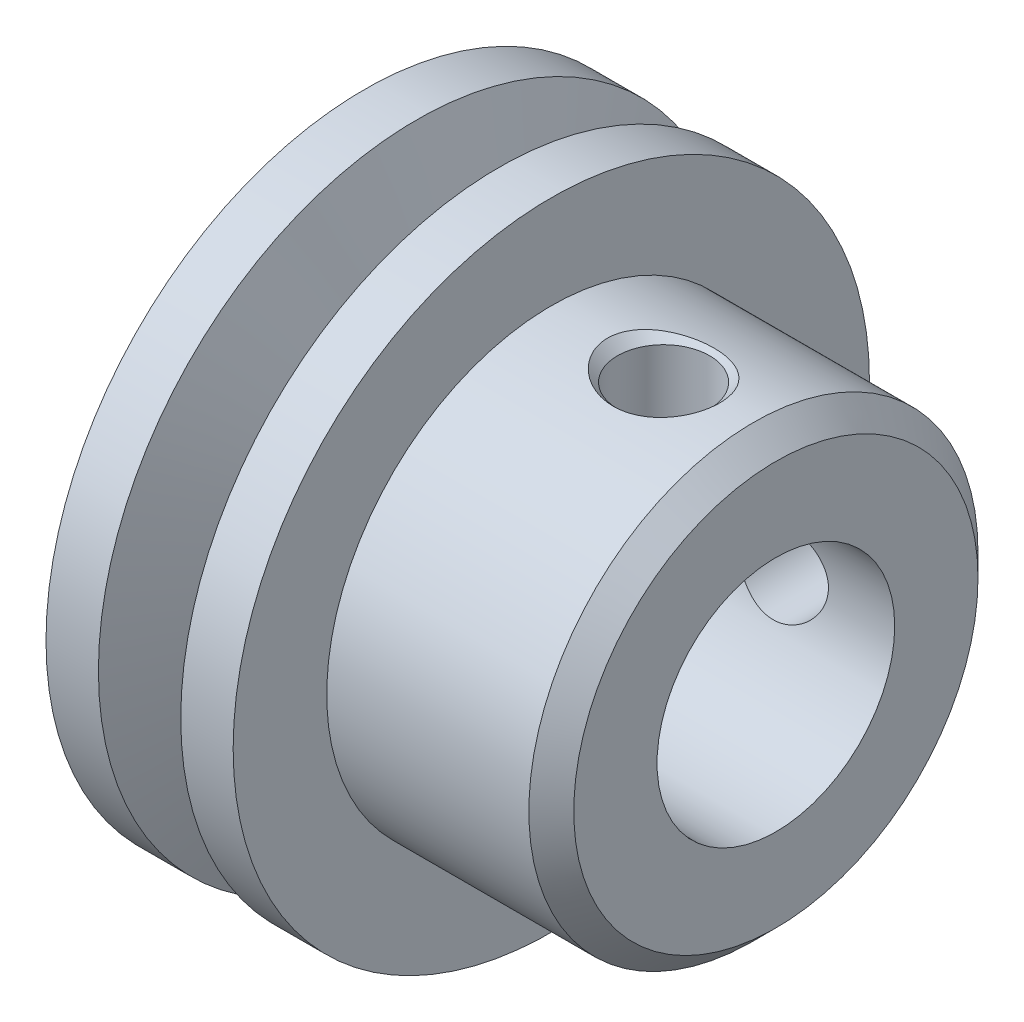
ISO-10303-21;
HEADER;
FILE_DESCRIPTION(('STEP AP214'),'2;1');
FILE_NAME('part.step','',(''),(''),'','','');
FILE_SCHEMA(('AUTOMOTIVE_DESIGN { 1 0 10303 214 1 1 1 1 }'));
ENDSEC;
DATA;
#1=APPLICATION_CONTEXT('core data for automotive mechanical design processes');
#2=APPLICATION_PROTOCOL_DEFINITION('international standard','automotive_design',2000,#1);
#3=PRODUCT_CONTEXT('',#1,'mechanical');
#4=PRODUCT('Part','Part','',(#3));
#5=PRODUCT_RELATED_PRODUCT_CATEGORY('part','',(#4));
#6=PRODUCT_DEFINITION_FORMATION('','',#4);
#7=PRODUCT_DEFINITION_CONTEXT('part definition',#1,'design');
#8=PRODUCT_DEFINITION('design','',#6,#7);
#9=PRODUCT_DEFINITION_SHAPE('','',#8);
#10=(LENGTH_UNIT() NAMED_UNIT(*) SI_UNIT(.MILLI.,.METRE.));
#11=(NAMED_UNIT(*) PLANE_ANGLE_UNIT() SI_UNIT($,.RADIAN.));
#12=(NAMED_UNIT(*) SI_UNIT($,.STERADIAN.) SOLID_ANGLE_UNIT());
#13=UNCERTAINTY_MEASURE_WITH_UNIT(LENGTH_MEASURE(1.E-05),#10,'distance_accuracy_value','');
#14=(GEOMETRIC_REPRESENTATION_CONTEXT(3) GLOBAL_UNCERTAINTY_ASSIGNED_CONTEXT((#13)) GLOBAL_UNIT_ASSIGNED_CONTEXT((#10,
#11,#12)) REPRESENTATION_CONTEXT('',''));
#15=CARTESIAN_POINT('',(0.,0.,0.));
#16=DIRECTION('',(0.,0.,1.));
#17=DIRECTION('',(1.,0.,0.));
#18=AXIS2_PLACEMENT_3D('',#15,#16,#17);
#19=CARTESIAN_POINT('',(2.5,0.,0.));
#20=DIRECTION('',(-1.,0.,0.));
#21=DIRECTION('',(0.,0.,1.));
#22=AXIS2_PLACEMENT_3D('',#19,#20,#21);
#23=CYLINDRICAL_SURFACE('',#22,8.5);
#24=CARTESIAN_POINT('',(2.5,0.,0.));
#25=DIRECTION('',(-1.,0.,0.));
#26=DIRECTION('',(0.,0.,1.));
#27=AXIS2_PLACEMENT_3D('',#24,#25,#26);
#28=CIRCLE('',#27,8.5);
#29=CARTESIAN_POINT('',(2.5,0.,8.5));
#30=VERTEX_POINT('',#29);
#31=EDGE_CURVE('E161',#30,#30,#28,.T.);
#32=ORIENTED_EDGE('',*,*,#31,.T.);
#33=EDGE_LOOP('',(#32));
#34=FACE_BOUND('',#33,.T.);
#35=CARTESIAN_POINT('',(1.1,0.,0.));
#36=DIRECTION('',(-1.,0.,0.));
#37=DIRECTION('',(0.,0.,1.));
#38=AXIS2_PLACEMENT_3D('',#35,#36,#37);
#39=CIRCLE('',#38,8.5);
#40=CARTESIAN_POINT('',(1.1,0.,8.5));
#41=VERTEX_POINT('',#40);
#42=EDGE_CURVE('E144',#41,#41,#39,.T.);
#43=ORIENTED_EDGE('',*,*,#42,.F.);
#44=EDGE_LOOP('',(#43));
#45=FACE_BOUND('',#44,.T.);
#46=ADVANCED_FACE('F30',(#34,#45),#23,.T.);
#47=CARTESIAN_POINT('',(2.5,8.5,0.));
#48=DIRECTION('',(1.,0.,0.));
#49=DIRECTION('',(0.,0.,-1.));
#50=AXIS2_PLACEMENT_3D('',#47,#48,#49);
#51=PLANE('',#50);
#52=CARTESIAN_POINT('',(2.5,0.,0.));
#53=DIRECTION('',(1.,0.,0.));
#54=DIRECTION('',(0.,0.,-1.));
#55=AXIS2_PLACEMENT_3D('',#52,#53,#54);
#56=CIRCLE('',#55,6.);
#57=CARTESIAN_POINT('',(2.5,0.,-6.));
#58=VERTEX_POINT('',#57);
#59=EDGE_CURVE('E153',#58,#58,#56,.T.);
#60=ORIENTED_EDGE('',*,*,#59,.F.);
#61=EDGE_LOOP('',(#60));
#62=FACE_BOUND('',#61,.T.);
#63=ORIENTED_EDGE('',*,*,#31,.F.);
#64=EDGE_LOOP('',(#63));
#65=FACE_BOUND('',#64,.T.);
#66=ADVANCED_FACE('F110',(#62,#65),#51,.T.);
#67=CARTESIAN_POINT('',(-2.5,0.,0.));
#68=DIRECTION('',(-1.,0.,0.));
#69=DIRECTION('',(0.,0.,1.));
#70=AXIS2_PLACEMENT_3D('',#67,#68,#69);
#71=PLANE('',#70);
#72=CARTESIAN_POINT('',(-2.5,0.,0.));
#73=DIRECTION('',(1.,0.,0.));
#74=DIRECTION('',(0.,0.,-1.));
#75=AXIS2_PLACEMENT_3D('',#72,#73,#74);
#76=CIRCLE('',#75,3.17500000000001);
#77=CARTESIAN_POINT('',(-2.5,0.,-3.17500000000001));
#78=VERTEX_POINT('',#77);
#79=EDGE_CURVE('E169',#78,#78,#76,.T.);
#80=ORIENTED_EDGE('',*,*,#79,.T.);
#81=EDGE_LOOP('',(#80));
#82=FACE_BOUND('',#81,.T.);
#83=CARTESIAN_POINT('',(-2.5,0.,0.));
#84=DIRECTION('',(-1.,0.,0.));
#85=DIRECTION('',(0.,0.,1.));
#86=AXIS2_PLACEMENT_3D('',#83,#84,#85);
#87=CIRCLE('',#86,8.5);
#88=CARTESIAN_POINT('',(-2.5,0.,8.5));
#89=VERTEX_POINT('',#88);
#90=EDGE_CURVE('E159',#89,#89,#87,.T.);
#91=ORIENTED_EDGE('',*,*,#90,.T.);
#92=EDGE_LOOP('',(#91));
#93=FACE_BOUND('',#92,.T.);
#94=ADVANCED_FACE('F115',(#82,#93),#71,.T.);
#95=CARTESIAN_POINT('',(2.5,0.,0.));
#96=DIRECTION('',(-1.,0.,0.));
#97=DIRECTION('',(0.,0.,1.));
#98=AXIS2_PLACEMENT_3D('',#95,#96,#97);
#99=CYLINDRICAL_SURFACE('',#98,8.5);
#100=CARTESIAN_POINT('',(-1.1,0.,0.));
#101=DIRECTION('',(-1.,0.,0.));
#102=DIRECTION('',(0.,0.,1.));
#103=AXIS2_PLACEMENT_3D('',#100,#101,#102);
#104=CIRCLE('',#103,8.5);
#105=CARTESIAN_POINT('',(-1.1,0.,8.5));
#106=VERTEX_POINT('',#105);
#107=EDGE_CURVE('E151',#106,#106,#104,.T.);
#108=ORIENTED_EDGE('',*,*,#107,.T.);
#109=EDGE_LOOP('',(#108));
#110=FACE_BOUND('',#109,.T.);
#111=ORIENTED_EDGE('',*,*,#90,.F.);
#112=EDGE_LOOP('',(#111));
#113=FACE_BOUND('',#112,.T.);
#114=ADVANCED_FACE('F123',(#110,#113),#99,.T.);
#115=CARTESIAN_POINT('',(-1.1,0.,0.));
#116=DIRECTION('',(-1.,0.,0.));
#117=DIRECTION('',(0.,0.,1.));
#118=AXIS2_PLACEMENT_3D('',#115,#116,#117);
#119=CONICAL_SURFACE('',#118,8.5,1.17809724508205);
#120=CARTESIAN_POINT('',(-0.271572875220727,0.,0.));
#121=DIRECTION('',(-1.,0.,0.));
#122=DIRECTION('',(0.,0.,1.));
#123=AXIS2_PLACEMENT_3D('',#120,#121,#122);
#124=CIRCLE('',#123,6.5);
#125=CARTESIAN_POINT('',(-0.271572875220727,0.,6.5));
#126=VERTEX_POINT('',#125);
#127=EDGE_CURVE('E148',#126,#126,#124,.T.);
#128=ORIENTED_EDGE('',*,*,#127,.T.);
#129=EDGE_LOOP('',(#128));
#130=FACE_BOUND('',#129,.T.);
#131=ORIENTED_EDGE('',*,*,#107,.F.);
#132=EDGE_LOOP('',(#131));
#133=FACE_BOUND('',#132,.T.);
#134=ADVANCED_FACE('F127',(#130,#133),#119,.T.);
#135=CARTESIAN_POINT('',(2.5,0.,0.));
#136=DIRECTION('',(-1.,0.,0.));
#137=DIRECTION('',(0.,0.,1.));
#138=AXIS2_PLACEMENT_3D('',#135,#136,#137);
#139=CYLINDRICAL_SURFACE('',#138,6.5);
#140=CARTESIAN_POINT('',(0.27157287525381,0.,0.));
#141=DIRECTION('',(-1.,0.,0.));
#142=DIRECTION('',(0.,0.,1.));
#143=AXIS2_PLACEMENT_3D('',#140,#141,#142);
#144=CIRCLE('',#143,6.5);
#145=CARTESIAN_POINT('',(0.27157287525381,0.,6.5));
#146=VERTEX_POINT('',#145);
#147=EDGE_CURVE('E147',#146,#146,#144,.T.);
#148=ORIENTED_EDGE('',*,*,#147,.T.);
#149=EDGE_LOOP('',(#148));
#150=FACE_BOUND('',#149,.T.);
#151=ORIENTED_EDGE('',*,*,#127,.F.);
#152=EDGE_LOOP('',(#151));
#153=FACE_BOUND('',#152,.T.);
#154=ADVANCED_FACE('F131',(#150,#153),#139,.T.);
#155=CARTESIAN_POINT('',(0.27157287525381,0.,0.));
#156=DIRECTION('',(1.,0.,0.));
#157=DIRECTION('',(0.,0.,-1.));
#158=AXIS2_PLACEMENT_3D('',#155,#156,#157);
#159=CONICAL_SURFACE('',#158,6.5,1.17809724509617);
#160=ORIENTED_EDGE('',*,*,#42,.T.);
#161=EDGE_LOOP('',(#160));
#162=FACE_BOUND('',#161,.T.);
#163=ORIENTED_EDGE('',*,*,#147,.F.);
#164=EDGE_LOOP('',(#163));
#165=FACE_BOUND('',#164,.T.);
#166=ADVANCED_FACE('F134',(#162,#165),#159,.T.);
#167=CARTESIAN_POINT('',(8.5,0.,0.));
#168=DIRECTION('',(-1.,0.,0.));
#169=DIRECTION('',(0.,0.,1.));
#170=AXIS2_PLACEMENT_3D('',#167,#168,#169);
#171=CYLINDRICAL_SURFACE('',#170,6.);
#172=CARTESIAN_POINT('',(7.89999999998008,0.,0.));
#173=DIRECTION('',(1.,0.,0.));
#174=DIRECTION('',(0.,0.,-1.));
#175=AXIS2_PLACEMENT_3D('',#172,#173,#174);
#176=CIRCLE('',#175,6.);
#177=CARTESIAN_POINT('',(7.89999999998008,0.,-6.));
#178=VERTEX_POINT('',#177);
#179=EDGE_CURVE('E10',#178,#178,#176,.F.);
#180=ORIENTED_EDGE('',*,*,#179,.T.);
#181=EDGE_LOOP('',(#180));
#182=FACE_BOUND('',#181,.T.);
#183=CARTESIAN_POINT('',(4.48757366091486,5.91742465217051,-0.992010854846125));
#184=CARTESIAN_POINT('',(4.55363181961201,5.90830786325476,-1.04639652813327));
#185=CARTESIAN_POINT('',(4.62453543924516,5.89938538901562,-1.09503950343004));
#186=CARTESIAN_POINT('',(4.77362862933216,5.88298642084079,-1.1799801888337));
#187=CARTESIAN_POINT('',(4.85183128037495,5.87551259972003,-1.21625517138769));
#188=CARTESIAN_POINT('',(5.01348918022317,5.86284003193611,-1.27594817621488));
#189=CARTESIAN_POINT('',(5.09696204273264,5.85764943245385,-1.29932023162618));
#190=CARTESIAN_POINT('',(5.26662594240205,5.85015953600291,-1.33263895459587));
#191=CARTESIAN_POINT('',(5.35281595388092,5.84785916110489,-1.34259062748078));
#192=CARTESIAN_POINT('',(5.52945215691767,5.84636934715403,-1.34906685056425));
#193=CARTESIAN_POINT('',(5.61992197284033,5.84731795903655,-1.34499551599462));
#194=CARTESIAN_POINT('',(5.79891432861927,5.85252314554906,-1.32215992489514));
#195=CARTESIAN_POINT('',(5.88743635456333,5.85678058268059,-1.30339183739719));
#196=CARTESIAN_POINT('',(6.0603123818507,5.86811483261557,-1.25137380475937));
#197=CARTESIAN_POINT('',(6.14464920160799,5.87520233488683,-1.21806890757161));
#198=CARTESIAN_POINT('',(6.30620910504696,5.8913301883883,-1.13750159188505));
#199=CARTESIAN_POINT('',(6.38343175476744,5.90037065863632,-1.09023832267039));
#200=CARTESIAN_POINT('',(6.52589828637423,5.91897143465703,-0.984166526779362));
#201=CARTESIAN_POINT('',(6.591428596566,5.92850850122736,-0.92574021387052));
#202=CARTESIAN_POINT('',(6.71052568987282,5.94709295036652,-0.797654746022983));
#203=CARTESIAN_POINT('',(6.76410021060564,5.95614064675901,-0.728002906655421));
#204=CARTESIAN_POINT('',(6.85233158078746,5.97170226674873,-0.586002349050411));
#205=CARTESIAN_POINT('',(6.8882581436275,5.97837104858305,-0.514462300386366));
#206=CARTESIAN_POINT('',(6.94589315456136,5.9893064221646,-0.365705879363942));
#207=CARTESIAN_POINT('',(6.96761698384612,5.99357561190214,-0.288495748728199));
#208=CARTESIAN_POINT('',(6.99380376850009,5.99875411035678,-0.140587670740879));
#209=CARTESIAN_POINT('',(7.00001250445118,6.00000266635157,-0.0702075260992267));
#210=CARTESIAN_POINT('',(6.99998747358026,5.99999732924591,0.0705405819267051));
#211=CARTESIAN_POINT('',(6.99375793668964,5.99874428687369,0.140908541316099));
#212=CARTESIAN_POINT('',(6.96991371137492,5.99403051456515,0.275464655883926));
#213=CARTESIAN_POINT('',(6.95296327147272,5.99069873300216,0.339777175910839));
#214=CARTESIAN_POINT('',(6.90910176683942,5.98229987141036,0.464775134725323));
#215=CARTESIAN_POINT('',(6.88218943791913,5.97723257114588,0.525460112032704));
#216=CARTESIAN_POINT('',(6.81811437272759,5.96560422923894,0.644435624101561));
#217=CARTESIAN_POINT('',(6.78055642539195,5.95898776607111,0.702506933408986));
#218=CARTESIAN_POINT('',(6.69712630096877,5.94502843099005,0.812220231927409));
#219=CARTESIAN_POINT('',(6.65125093814583,5.93768528123257,0.863859744803153));
#220=CARTESIAN_POINT('',(6.54735531231745,5.92213282529493,0.965003618208063));
#221=CARTESIAN_POINT('',(6.48856591863458,5.91391344831605,1.01371604963098));
#222=CARTESIAN_POINT('',(6.36421874892842,5.8981591382164,1.10168963583188));
#223=CARTESIAN_POINT('',(6.29865796453468,5.89062451213327,1.14094656371948));
#224=CARTESIAN_POINT('',(6.15530569309493,5.876216745316,1.21308430597829));
#225=CARTESIAN_POINT('',(6.07695114801924,5.86949362202817,1.24487917351758));
#226=CARTESIAN_POINT('',(5.91608850667425,5.85844272780628,1.29589019358384));
#227=CARTESIAN_POINT('',(5.83357923919134,5.85411563648293,1.31510277755287));
#228=CARTESIAN_POINT('',(5.66165359695121,5.84814906802447,1.34139907834455));
#229=CARTESIAN_POINT('',(5.57211346562383,5.84667917739019,1.34771852252401));
#230=CARTESIAN_POINT('',(5.39318722341021,5.84710995108764,1.34584711224697));
#231=CARTESIAN_POINT('',(5.30380113588577,5.84901108815313,1.33765422266343));
#232=CARTESIAN_POINT('',(5.12640318954032,5.85601026980822,1.30667462121034));
#233=CARTESIAN_POINT('',(5.03842878104088,5.86115325678942,1.28368265053342));
#234=CARTESIAN_POINT('',(4.86774564779565,5.87405421705983,1.22328873878857));
#235=CARTESIAN_POINT('',(4.78503763362446,5.88181254234158,1.18588485795687));
#236=CARTESIAN_POINT('',(4.62868834758188,5.89885584024847,1.09793936148491));
#237=CARTESIAN_POINT('',(4.55493159595345,5.90811667587562,1.0475991055677));
#238=CARTESIAN_POINT('',(4.41775902049772,5.92707191538146,0.934397619190823));
#239=CARTESIAN_POINT('',(4.3543401267073,5.93676618945117,0.871540118255766));
#240=CARTESIAN_POINT('',(4.24451804836834,5.95462981302145,0.739274435941501));
#241=CARTESIAN_POINT('',(4.19725931708155,5.96285781968524,0.670587636857619));
#242=CARTESIAN_POINT('',(4.11666617177209,5.97740414856912,0.525298729266001));
#243=CARTESIAN_POINT('',(4.08331636604259,5.9837245795721,0.44870548784417));
#244=CARTESIAN_POINT('',(4.03561102361376,5.99292477914225,0.299597112631546));
#245=CARTESIAN_POINT('',(4.01947649569918,5.99612289589478,0.227669805112668));
#246=CARTESIAN_POINT('',(4.00056994460918,5.99988014656912,0.0820252488615707));
#247=CARTESIAN_POINT('',(3.99778908698481,6.00044102521554,0.00830921596217015));
#248=CARTESIAN_POINT('',(4.00538396522914,5.99892462615997,-0.131853900867108));
#249=CARTESIAN_POINT('',(4.0146209857414,5.99707565796216,-0.198368680010217));
#250=CARTESIAN_POINT('',(4.04385152538657,5.99133485318473,-0.328901096278445));
#251=CARTESIAN_POINT('',(4.06384716852704,5.98744261321844,-0.392918237633052));
#252=CARTESIAN_POINT('',(4.11392223533623,5.97797718597371,-0.517427587169158));
#253=CARTESIAN_POINT('',(4.14409625848337,5.97238828025757,-0.577880233499699));
#254=CARTESIAN_POINT('',(4.21327228913968,5.96009115091553,-0.693313939580885));
#255=CARTESIAN_POINT('',(4.25226932215909,5.95338355857287,-0.748298057484379));
#256=CARTESIAN_POINT('',(4.32392793662147,5.94170390349792,-0.835108820874635));
#257=CARTESIAN_POINT('',(4.35454975603995,5.93687348554887,-0.868667333602712));
#258=CARTESIAN_POINT('',(4.41885111111889,5.92715203379582,-0.932692841042324));
#259=CARTESIAN_POINT('',(4.45253058668691,5.92226100118471,-0.963159896485691));
#260=CARTESIAN_POINT('',(4.48757366091486,5.91742465217051,-0.992010854846125));
#261=B_SPLINE_CURVE_WITH_KNOTS('',3,(#183,#184,#185,#186,#187,#188,#189,#190,#191,#192,#193,
#194,#195,#196,#197,#198,#199,#200,#201,#202,#203,#204,#205,#206,#207,#208,#209,#210,#211,#212,
#213,#214,#215,#216,#217,#218,#219,#220,#221,#222,#223,#224,#225,#226,#227,#228,#229,#230,#231,
#232,#233,#234,#235,#236,#237,#238,#239,#240,#241,#242,#243,#244,#245,#246,#247,#248,#249,#250,
#251,#252,#253,#254,#255,#256,#257,#258,#259,#260),.UNSPECIFIED.,.T.,.F.,(4,2,2,2,2,2,2,2,2,2,2,
2,2,2,2,2,2,2,2,2,2,2,2,2,2,2,2,2,2,2,2,2,2,2,2,2,2,2,4),(0.,0.257980145715,0.516431835124361,
0.775798416689689,1.0350682369446,1.30548879870758,1.575979873838,1.84750243695284,
2.11904155187145,2.3825608334294,2.6459090712264,2.88552537656222,3.12488175192343,
3.33576723437471,3.54658101240203,3.74546460939209,3.94437345387675,4.15194095008804,
4.35958811737834,4.58901282748934,4.81853990768817,5.07190982687174,5.32535157515601,
5.59342526363917,5.86153654822607,6.13344901182128,6.40539808612891,6.67334659781005,
6.94121539311679,7.19113126605655,7.44076984192971,7.66090547990702,7.88089546165662,
8.08148342523696,8.28211100418259,8.48465712068415,8.68708932324999,8.82394743754306,
8.96080286273096),.UNSPECIFIED.);
#262=CARTESIAN_POINT('',(4.48757366091486,5.91742465217051,-0.992010854846125));
#263=VERTEX_POINT('',#262);
#264=EDGE_CURVE('E41',#263,#263,#261,.T.);
#265=ORIENTED_EDGE('',*,*,#264,.T.);
#266=EDGE_LOOP('',(#265));
#267=FACE_BOUND('',#266,.T.);
#268=CARTESIAN_POINT('',(4.48757366103645,-0.992010854743913,-5.91742465218764));
#269=CARTESIAN_POINT('',(4.5536318197212,-1.0463965280255,-5.90830786327379));
#270=CARTESIAN_POINT('',(4.62453543934137,-1.09503950331784,-5.89938538903642));
#271=CARTESIAN_POINT('',(4.77362862940185,-1.17998018871469,-5.88298642086463));
#272=CARTESIAN_POINT('',(4.85183128043109,-1.21625517126632,-5.87551259974514));
#273=CARTESIAN_POINT('',(5.01348918025157,-1.2759481760905,-5.86284003196317));
#274=CARTESIAN_POINT('',(5.09696204274683,-1.29932023150122,-5.85764943248157));
#275=CARTESIAN_POINT('',(5.26662594238793,-1.3326389544717,-5.8501595360312));
#276=CARTESIAN_POINT('',(5.35281595385271,-1.34259062735796,-5.84785916113309));
#277=CARTESIAN_POINT('',(5.52945215685946,-1.34906685044603,-5.84636934718131));
#278=CARTESIAN_POINT('',(5.61992197276623,-1.34499551587997,-5.84731795906291));
#279=CARTESIAN_POINT('',(5.79891432851421,-1.32215992479014,-5.85252314557277));
#280=CARTESIAN_POINT('',(5.88743635444319,-1.30339183729827,-5.85678058270258));
#281=CARTESIAN_POINT('',(6.06031238170173,-1.2513738046751,-5.8681148326335));
#282=CARTESIAN_POINT('',(6.14464920144525,-1.21806890749591,-5.87520233490245));
#283=CARTESIAN_POINT('',(6.30620910485859,-1.13750159182907,-5.89133018839904));
#284=CARTESIAN_POINT('',(6.38343175456719,-1.09023832262556,-5.90037065864448));
#285=CARTESIAN_POINT('',(6.52589828615489,-0.984166526757887,-5.9189714346605));
#286=CARTESIAN_POINT('',(6.59142859633914,-0.925740213860899,-5.92850850122872));
#287=CARTESIAN_POINT('',(6.71052568963406,-0.797654746038963,-5.94709295036424));
#288=CARTESIAN_POINT('',(6.76410021036249,-0.728002906685138,-5.9561406467552));
#289=CARTESIAN_POINT('',(6.8523315805426,-0.586002349103613,-5.9717022667434));
#290=CARTESIAN_POINT('',(6.88825814338421,-0.514462300448715,-5.97837104857757));
#291=CARTESIAN_POINT('',(6.94589315432384,-0.36570587944439,-5.98930642215958));
#292=CARTESIAN_POINT('',(6.96761698361278,-0.288495748817597,-5.99357561189773));
#293=CARTESIAN_POINT('',(6.99380376827799,-0.140587670842001,-5.99875411035437));
#294=CARTESIAN_POINT('',(7.00001250423509,-0.0702075262030989,-6.00000266635033));
#295=CARTESIAN_POINT('',(6.99998747337661,0.0705405818184794,-5.99999732924716));
#296=CARTESIAN_POINT('',(6.99375793649242,0.140908541206269,-5.99874428687626));
#297=CARTESIAN_POINT('',(6.96991371119016,0.275464655772296,-5.99403051457027));
#298=CARTESIAN_POINT('',(6.95296327129396,0.339777175798943,-5.99069873300851));
#299=CARTESIAN_POINT('',(6.90910176667224,0.464775134613711,-5.98229987141903));
#300=CARTESIAN_POINT('',(6.88218943775753,0.525460111921641,-5.97723257115565));
#301=CARTESIAN_POINT('',(6.81811437257795,0.644435623989818,-5.965604229251));
#302=CARTESIAN_POINT('',(6.78055642524904,0.702506933296241,-5.9589877660844));
#303=CARTESIAN_POINT('',(6.697126300839,0.812220231813347,-5.94502843100563));
#304=CARTESIAN_POINT('',(6.65125093802248,0.863859744688776,-5.93768528124921));
#305=CARTESIAN_POINT('',(6.54735531220968,0.965003618090935,-5.92213282531399));
#306=CARTESIAN_POINT('',(6.48856591853633,1.01371604951186,-5.91391344833645));
#307=CARTESIAN_POINT('',(6.36421874884918,1.10168963570982,-5.89815913823919));
#308=CARTESIAN_POINT('',(6.29865796446492,1.14094656359646,-5.8906245121571));
#309=CARTESIAN_POINT('',(6.15530569304793,1.21308430585257,-5.87621674534194));
#310=CARTESIAN_POINT('',(6.07695114798573,1.2448791733907,-5.86949362205508));
#311=CARTESIAN_POINT('',(5.91608850666771,1.29589019345639,-5.85844272783447));
#312=CARTESIAN_POINT('',(5.83357923919828,1.31510277742603,-5.85411563651143));
#313=CARTESIAN_POINT('',(5.66165359698748,1.34139907822035,-5.84814906805296));
#314=CARTESIAN_POINT('',(5.57211346567599,1.34771852240226,-5.84667917741826));
#315=CARTESIAN_POINT('',(5.39318722349352,1.34584711213251,-5.84710995111398));
#316=CARTESIAN_POINT('',(5.30380113598435,1.33765422255383,-5.84901108817818));
#317=CARTESIAN_POINT('',(5.12640318966897,1.30667462111293,-5.85601026982994));
#318=CARTESIAN_POINT('',(5.0384287811843,1.28368265044344,-5.86115325680908));
#319=CARTESIAN_POINT('',(4.86774564796703,1.22328873871603,-5.87405421707489));
#320=CARTESIAN_POINT('',(4.78503763380903,1.18588485789432,-5.88181254235411));
#321=CARTESIAN_POINT('',(4.62868834778938,1.09793936144421,-5.89885584025597));
#322=CARTESIAN_POINT('',(4.55493159617081,1.04759910553864,-5.90811667588065));
#323=CARTESIAN_POINT('',(4.41775902073198,0.934397619187291,-5.92707191538189));
#324=CARTESIAN_POINT('',(4.3543401269486,0.871540118266114,-5.93676618944948));
#325=CARTESIAN_POINT('',(4.24451804861677,0.739274435977521,-5.95462981301686));
#326=CARTESIAN_POINT('',(4.19725931733089,0.67058763690482,-5.96285781967979));
#327=CARTESIAN_POINT('',(4.11666617202007,0.525298729336038,-5.97740414856283));
#328=CARTESIAN_POINT('',(4.08331636628831,0.448705487925854,-5.98372457956583));
#329=CARTESIAN_POINT('',(4.0356110238501,0.299597112729912,-5.99292477913728));
#330=CARTESIAN_POINT('',(4.01947649592969,0.227669805215823,-5.99612289589081));
#331=CARTESIAN_POINT('',(4.00056994482692,0.0820252489731329,-5.99988014656755));
#332=CARTESIAN_POINT('',(3.99778908719561,0.00830921607735142,-6.00044102521535));
#333=CARTESIAN_POINT('',(4.00538396542611,-0.131853900747973,-5.99892462616258));
#334=CARTESIAN_POINT('',(4.01462098593181,-0.198368679890612,-5.99707565796612));
#335=CARTESIAN_POINT('',(4.04385152556417,-0.328901096158918,-5.99133485319129));
#336=CARTESIAN_POINT('',(4.06384716869841,-0.392918237514074,-5.98744261322625));
#337=CARTESIAN_POINT('',(4.11392223549501,-0.517427587050139,-5.977977185984));
#338=CARTESIAN_POINT('',(4.14409625863548,-0.577880233380223,-5.97238828026913));
#339=CARTESIAN_POINT('',(4.21327228927889,-0.693313939461237,-5.96009115092945));
#340=CARTESIAN_POINT('',(4.25226932229206,-0.748298057365017,-5.95338355858788));
#341=CARTESIAN_POINT('',(4.32392793674682,-0.835108820758911,-5.94170390351421));
#342=CARTESIAN_POINT('',(4.35454975616403,-0.868667333489993,-5.93687348556538));
#343=CARTESIAN_POINT('',(4.41885111124117,-0.932692840935201,-5.92715203381269));
#344=CARTESIAN_POINT('',(4.45253058680867,-0.963159896381159,-5.92226100120173));
#345=CARTESIAN_POINT('',(4.48757366103645,-0.992010854743913,-5.91742465218764));
#346=B_SPLINE_CURVE_WITH_KNOTS('',3,(#268,#269,#270,#271,#272,#273,#274,#275,#276,#277,#278,
#279,#280,#281,#282,#283,#284,#285,#286,#287,#288,#289,#290,#291,#292,#293,#294,#295,#296,#297,
#298,#299,#300,#301,#302,#303,#304,#305,#306,#307,#308,#309,#310,#311,#312,#313,#314,#315,#316,
#317,#318,#319,#320,#321,#322,#323,#324,#325,#326,#327,#328,#329,#330,#331,#332,#333,#334,#335,
#336,#337,#338,#339,#340,#341,#342,#343,#344,#345),.UNSPECIFIED.,.T.,.F.,(4,2,2,2,2,2,2,2,2,2,2,
2,2,2,2,2,2,2,2,2,2,2,2,2,2,2,2,2,2,2,2,2,2,2,2,2,2,2,4),(0.,0.257980145675291,
0.516431835044742,0.775798416568639,1.03506823678217,1.30548879849723,1.57597987357969,
1.84750243664654,2.11904155151714,2.38256083303449,2.64590907079108,2.8855253761048,
3.12488175144409,3.33576723388884,3.54658101190963,3.74546460889413,3.94437345337321,
4.15194094957073,4.35958811684723,4.58901282693221,4.81853990710496,5.07190982624972,
5.32535157449514,5.59342526293151,5.8615365474716,6.13344901101826,6.40539808527732,
6.67334659691411,6.9412153921766,7.19113126508739,7.44076984093181,7.66090547889919,
7.88089546063888,8.08148342421497,8.28211100315632,8.48465711964744,8.68708932220282,
8.82394743649981,8.96080286169163),.UNSPECIFIED.);
#347=CARTESIAN_POINT('',(4.48757366103645,-0.992010854743913,-5.91742465218764));
#348=VERTEX_POINT('',#347);
#349=EDGE_CURVE('E45',#348,#348,#346,.T.);
#350=ORIENTED_EDGE('',*,*,#349,.T.);
#351=EDGE_LOOP('',(#350));
#352=FACE_BOUND('',#351,.T.);
#353=ORIENTED_EDGE('',*,*,#59,.T.);
#354=EDGE_LOOP('',(#353));
#355=FACE_BOUND('',#354,.T.);
#356=ADVANCED_FACE('F56',(#182,#267,#352,#355),#171,.T.);
#357=CARTESIAN_POINT('',(8.5,0.,0.));
#358=DIRECTION('',(1.,0.,0.));
#359=DIRECTION('',(0.,0.,-1.));
#360=AXIS2_PLACEMENT_3D('',#357,#358,#359);
#361=PLANE('',#360);
#362=CARTESIAN_POINT('',(8.5,0.,0.));
#363=DIRECTION('',(1.,0.,0.));
#364=DIRECTION('',(0.,0.,-1.));
#365=AXIS2_PLACEMENT_3D('',#362,#363,#364);
#366=CIRCLE('',#365,5.39999999998008);
#367=CARTESIAN_POINT('',(8.5,0.,-5.39999999998008));
#368=VERTEX_POINT('',#367);
#369=EDGE_CURVE('E37',#368,#368,#366,.T.);
#370=ORIENTED_EDGE('',*,*,#369,.T.);
#371=EDGE_LOOP('',(#370));
#372=FACE_BOUND('',#371,.T.);
#373=CARTESIAN_POINT('',(8.5,0.,0.));
#374=DIRECTION('',(1.,0.,0.));
#375=DIRECTION('',(0.,0.,-1.));
#376=AXIS2_PLACEMENT_3D('',#373,#374,#375);
#377=CIRCLE('',#376,3.17500000000001);
#378=CARTESIAN_POINT('',(8.5,0.,-3.17500000000001));
#379=VERTEX_POINT('',#378);
#380=EDGE_CURVE('E90',#379,#379,#377,.T.);
#381=ORIENTED_EDGE('',*,*,#380,.F.);
#382=EDGE_LOOP('',(#381));
#383=FACE_BOUND('',#382,.T.);
#384=ADVANCED_FACE('F105',(#372,#383),#361,.T.);
#385=CARTESIAN_POINT('',(8.5,0.,0.));
#386=DIRECTION('',(1.,0.,0.));
#387=DIRECTION('',(0.,0.,-1.));
#388=AXIS2_PLACEMENT_3D('',#385,#386,#387);
#389=CYLINDRICAL_SURFACE('',#388,3.17500000000001);
#390=CARTESIAN_POINT('',(5.5,2.92727770291787,1.22949999999999));
#391=CARTESIAN_POINT('',(5.56621765571292,2.92727447725566,1.22950333490589));
#392=CARTESIAN_POINT('',(5.63241424299067,2.9295488591685,1.2241328904863));
#393=CARTESIAN_POINT('',(5.76280115111501,2.93833101541693,1.20289941102294));
#394=CARTESIAN_POINT('',(5.82699163011982,2.94483845513846,1.18703720532851));
#395=CARTESIAN_POINT('',(5.95144273948371,2.96124138619426,1.14549809796639));
#396=CARTESIAN_POINT('',(6.01171290142795,2.97112826415674,1.11984612886075));
#397=CARTESIAN_POINT('',(6.12711823049618,2.99316174761618,1.05954476190847));
#398=CARTESIAN_POINT('',(6.18225174486622,3.00530907668742,1.02489248163714));
#399=CARTESIAN_POINT('',(6.28874535099263,3.03121684305943,0.945604490201628));
#400=CARTESIAN_POINT('',(6.33979472676831,3.04502684733287,0.90056753654408));
#401=CARTESIAN_POINT('',(6.43383728177334,3.07229196898109,0.802638410729977));
#402=CARTESIAN_POINT('',(6.47682859218503,3.08574700341151,0.749744421464232));
#403=CARTESIAN_POINT('',(6.5550595828732,3.11138028141574,0.635216755130677));
#404=CARTESIAN_POINT('',(6.58995765331669,3.1234937061312,0.573333921432763));
#405=CARTESIAN_POINT('',(6.64871735183899,3.14447923435931,0.444023058703522));
#406=CARTESIAN_POINT('',(6.67258308239917,3.15335254248209,0.376597101939238));
#407=CARTESIAN_POINT('',(6.70749925236463,3.16650587193297,0.241383276582411));
#408=CARTESIAN_POINT('',(6.7190854784414,3.17097726441067,0.173752748130025));
#409=CARTESIAN_POINT('',(6.73083461944757,3.17551211852081,0.0373692937817401));
#410=CARTESIAN_POINT('',(6.73100149605487,3.175577108852,-0.0313832345825053));
#411=CARTESIAN_POINT('',(6.72021036258315,3.1714110077804,-0.164203193620193));
#412=CARTESIAN_POINT('',(6.70983819795178,3.1674061499627,-0.228326576917081));
#413=CARTESIAN_POINT('',(6.67925420278206,3.15585104073879,-0.353840496131779));
#414=CARTESIAN_POINT('',(6.65904167110187,3.14830053670099,-0.415230836975717));
#415=CARTESIAN_POINT('',(6.60909916140353,3.13025676364728,-0.534621320566289));
#416=CARTESIAN_POINT('',(6.57923238824009,3.11972148450901,-0.592557628630518));
#417=CARTESIAN_POINT('',(6.51095354597627,3.09676435886256,-0.702743016993317));
#418=CARTESIAN_POINT('',(6.47253862722401,3.08434188366862,-0.754990192063794));
#419=CARTESIAN_POINT('',(6.38547423086628,3.05797240377902,-0.855750371768533));
#420=CARTESIAN_POINT('',(6.33633793557281,3.04397863008216,-0.903831127973078));
#421=CARTESIAN_POINT('',(6.23062945918302,3.01664888024007,-0.991239895655576));
#422=CARTESIAN_POINT('',(6.17405515454192,3.00331309345051,-1.03056539884828));
#423=CARTESIAN_POINT('',(6.05326212830077,2.97850309859302,-1.10025043454688));
#424=CARTESIAN_POINT('',(5.98888750529695,2.9670838436136,-1.1303608988458));
#425=CARTESIAN_POINT('',(5.8554218649662,2.94803892035063,-1.17914612552283));
#426=CARTESIAN_POINT('',(5.78633371045943,2.94041097229189,-1.19782776180725));
#427=CARTESIAN_POINT('',(5.6496946884861,2.93035755033078,-1.22220889351824));
#428=CARTESIAN_POINT('',(5.58228770891406,2.92765556856922,-1.22859957209784));
#429=CARTESIAN_POINT('',(5.44732511804732,2.92697472863695,-1.23022211360479));
#430=CARTESIAN_POINT('',(5.3797695526619,2.92899457339037,-1.22545704099318));
#431=CARTESIAN_POINT('',(5.25011143095889,2.9372475229798,-1.20553137595057));
#432=CARTESIAN_POINT('',(5.187907915628,2.94325628175485,-1.19092373025186));
#433=CARTESIAN_POINT('',(5.06686926220203,2.95853802652828,-1.15243367872725));
#434=CARTESIAN_POINT('',(5.00803484480142,2.96781170792647,-1.12854929692623));
#435=CARTESIAN_POINT('',(4.89284701139393,2.98902256971012,-1.07113851231947));
#436=CARTESIAN_POINT('',(4.836680095736,3.00104959099579,-1.03727211932349));
#437=CARTESIAN_POINT('',(4.73058249540365,3.02626784536559,-0.96121343720217));
#438=CARTESIAN_POINT('',(4.68065423292165,3.03945952726444,-0.919017930552705));
#439=CARTESIAN_POINT('',(4.58490526025724,3.06661067394392,-0.82408755920089));
#440=CARTESIAN_POINT('',(4.53959906228925,3.08056094048055,-0.77082923262813));
#441=CARTESIAN_POINT('',(4.45849653007387,3.10680039187677,-0.657127259244018));
#442=CARTESIAN_POINT('',(4.4227003882067,3.11908954313096,-0.596683467112713));
#443=CARTESIAN_POINT('',(4.36182403663774,3.14063497402501,-0.470250929478878));
#444=CARTESIAN_POINT('',(4.33672231112934,3.14989733434751,-0.404273640007396));
#445=CARTESIAN_POINT('',(4.29812723218031,3.16435287357066,-0.268589141831312));
#446=CARTESIAN_POINT('',(4.28462801368683,3.16954810827967,-0.198883836586));
#447=CARTESIAN_POINT('',(4.27028447296127,3.17507729643103,-0.0623571377081332));
#448=CARTESIAN_POINT('',(4.26871093482714,3.17569133598912,0.00437693747971601));
#449=CARTESIAN_POINT('',(4.27636355517967,3.17273195328416,0.137121263174395));
#450=CARTESIAN_POINT('',(4.28558826104361,3.1691590942593,0.203131609834422));
#451=CARTESIAN_POINT('',(4.31405831921294,3.15836137162301,0.330710673887426));
#452=CARTESIAN_POINT('',(4.33302244929022,3.15123915695614,0.392351512884613));
#453=CARTESIAN_POINT('',(4.38014572004886,3.13409447162418,0.511573914997664));
#454=CARTESIAN_POINT('',(4.40830660086491,3.12407145213317,0.569154707395421));
#455=CARTESIAN_POINT('',(4.47440190983902,3.10158037351158,0.681351339134705));
#456=CARTESIAN_POINT('',(4.51270598634687,3.08902539702573,0.735731647996979));
#457=CARTESIAN_POINT('',(4.59743068835833,3.06299885435049,0.837512647768226));
#458=CARTESIAN_POINT('',(4.64385427981622,3.04952695432302,0.884910776480688));
#459=CARTESIAN_POINT('',(4.74664767990529,3.02223521994012,0.974178001807388));
#460=CARTESIAN_POINT('',(4.80343418606775,3.00843947540279,1.01557655057912));
#461=CARTESIAN_POINT('',(4.92358901700227,2.9829117021356,1.0882796885473));
#462=CARTESIAN_POINT('',(4.9869588921678,2.97118016128906,1.11958189288235));
#463=CARTESIAN_POINT('',(5.12344260260787,2.95057503469019,1.17286675436243));
#464=CARTESIAN_POINT('',(5.1969297806628,2.94197026194952,1.19400937215125));
#465=CARTESIAN_POINT('',(5.346955659796,2.9303256652383,1.22231852873024));
#466=CARTESIAN_POINT('',(5.42349189262672,2.92728142985908,1.22949614683824));
#467=CARTESIAN_POINT('',(5.5,2.92727770291787,1.22949999999999));
#468=B_SPLINE_CURVE_WITH_KNOTS('',3,(#390,#391,#392,#393,#394,#395,#396,#397,#398,#399,#400,
#401,#402,#403,#404,#405,#406,#407,#408,#409,#410,#411,#412,#413,#414,#415,#416,#417,#418,#419,
#420,#421,#422,#423,#424,#425,#426,#427,#428,#429,#430,#431,#432,#433,#434,#435,#436,#437,#438,
#439,#440,#441,#442,#443,#444,#445,#446,#447,#448,#449,#450,#451,#452,#453,#454,#455,#456,#457,
#458,#459,#460,#461,#462,#463,#464,#465,#466,#467),.UNSPECIFIED.,.T.,.F.,(4,2,2,2,2,2,2,2,2,2,2,
2,2,2,2,2,2,2,2,2,2,2,2,2,2,2,2,2,2,2,2,2,2,2,2,2,2,2,4),(0.,0.198367600022193,0.39671952142028,
0.594569615487288,0.792483150993536,0.999952413391155,1.20746973245732,1.42258810127052,
1.63762641177839,1.84283805377352,2.04797850199757,2.24230754284545,2.43665043197408,
2.63387753430371,2.83117048399336,3.04069350471219,3.25027647448729,3.46510554553451,
3.67980527957004,3.88203130286327,4.08420178161787,4.27586877096114,4.46757660840868,
4.66676794070653,4.86603637143688,5.0789340935724,5.29183612211674,5.50430777264764,
5.71667195574899,5.9159371560314,6.11517555344701,6.30895991096498,6.50278095605376,
6.70497470239378,6.90724246235376,7.1210653077542,7.33493862340535,7.56431528471908,
7.79350989269001),.UNSPECIFIED.);
#469=CARTESIAN_POINT('',(5.5,2.92727770291787,1.22949999999999));
#470=VERTEX_POINT('',#469);
#471=EDGE_CURVE('E73',#470,#470,#468,.T.);
#472=ORIENTED_EDGE('',*,*,#471,.T.);
#473=EDGE_LOOP('',(#472));
#474=FACE_BOUND('',#473,.T.);
#475=CARTESIAN_POINT('',(4.27050000000001,0.,-3.17500000000001));
#476=CARTESIAN_POINT('',(4.27049683753117,0.0664294786624811,-3.17500242171084));
#477=CARTESIAN_POINT('',(4.27590029934116,0.132838065182366,-3.17289740345893));
#478=CARTESIAN_POINT('',(4.2972769738561,0.263662191692077,-3.16471157372537));
#479=CARTESIAN_POINT('',(4.31324791039506,0.32807815775262,-3.15863161842292));
#480=CARTESIAN_POINT('',(4.35510432916125,0.453010650226008,-3.14314592971078));
#481=CARTESIAN_POINT('',(4.38096991438074,0.513534719326034,-3.13374687353101));
#482=CARTESIAN_POINT('',(4.44177670274665,0.629377660679992,-3.1125521342714));
#483=CARTESIAN_POINT('',(4.47672050035488,0.684695038747161,-3.10075576627416));
#484=CARTESIAN_POINT('',(4.55632544127567,0.791035180010784,-3.07538584353737));
#485=CARTESIAN_POINT('',(4.60132225700422,0.841793994349152,-3.0617597290125));
#486=CARTESIAN_POINT('',(4.69904334036208,0.935260844078301,-3.03451586390157));
#487=CARTESIAN_POINT('',(4.75177019627654,0.977966171889656,-3.02089811765718));
#488=CARTESIAN_POINT('',(4.8660985116798,1.0558483934047,-2.99459033864624));
#489=CARTESIAN_POINT('',(4.92797599131374,1.09064290099373,-2.98196159194099));
#490=CARTESIAN_POINT('',(5.05726947299023,1.14921295081486,-2.95988540722389));
#491=CARTESIAN_POINT('',(5.12468308068087,1.17299322741403,-2.95043660282109));
#492=CARTESIAN_POINT('',(5.26008953358595,1.20780198961704,-2.93635492395467));
#493=CARTESIAN_POINT('',(5.3279318062764,1.21933653749689,-2.93153179784333));
#494=CARTESIAN_POINT('',(5.46474730186195,1.23090815476872,-2.92669326990317));
#495=CARTESIAN_POINT('',(5.53372000303509,1.23095038659576,-2.92667570937801));
#496=CARTESIAN_POINT('',(5.66609865953552,1.219921395121,-2.93128711875886));
#497=CARTESIAN_POINT('',(5.72957673605501,1.20956678141105,-2.93561647412535));
#498=CARTESIAN_POINT('',(5.85381186028273,1.17922763129578,-2.94793358209465));
#499=CARTESIAN_POINT('',(5.91456846817522,1.15924154444394,-2.95592192370017));
#500=CARTESIAN_POINT('',(6.03304507320398,1.10983562734989,-2.97482751316339));
#501=CARTESIAN_POINT('',(6.09068181527474,1.08023794003097,-2.9857992903547));
#502=CARTESIAN_POINT('',(6.20037276034706,1.01257334745646,-3.00941888025507));
#503=CARTESIAN_POINT('',(6.25242493879571,0.974503386049247,-3.02206729710066));
#504=CARTESIAN_POINT('',(6.35341492514898,0.887748092659995,-3.04872579844006));
#505=CARTESIAN_POINT('',(6.4018581744689,0.838495573955571,-3.06276833255793));
#506=CARTESIAN_POINT('',(6.48994993810358,0.732409599940687,-3.08985362345726));
#507=CARTESIAN_POINT('',(6.52959691550508,0.67557482260682,-3.10289620526367));
#508=CARTESIAN_POINT('',(6.59956537564102,0.554608212120445,-3.126802876099));
#509=CARTESIAN_POINT('',(6.62971187324646,0.490366261076628,-3.13762493401224));
#510=CARTESIAN_POINT('',(6.67860251672971,0.357198298426015,-3.15555664038322));
#511=CARTESIAN_POINT('',(6.69735207722455,0.288274528454483,-3.16266805151945));
#512=CARTESIAN_POINT('',(6.72194204302267,0.151853673750736,-3.1720618173605));
#513=CARTESIAN_POINT('',(6.72844776619673,0.0844935413936915,-3.17459274693975));
#514=CARTESIAN_POINT('',(6.73031582121579,-0.0503962914320527,-3.17531570746801));
#515=CARTESIAN_POINT('',(6.72568082163555,-0.11792594742348,-3.17350877747922));
#516=CARTESIAN_POINT('',(6.70589697735668,-0.248295215672028,-3.16592251992034));
#517=CARTESIAN_POINT('',(6.69119278142788,-0.311213133053881,-3.16031128803361));
#518=CARTESIAN_POINT('',(6.65228282074713,-0.433637927550875,-3.14585211761306));
#519=CARTESIAN_POINT('',(6.62807582523958,-0.493144361683031,-3.13700375983282));
#520=CARTESIAN_POINT('',(6.57006455863127,-0.609064147618344,-3.11660636520743));
#521=CARTESIAN_POINT('',(6.53599381820674,-0.6653308750305,-3.1049841816464));
#522=CARTESIAN_POINT('',(6.45952055407595,-0.771541907295074,-3.08031262701551));
#523=CARTESIAN_POINT('',(6.41711481844106,-0.821483762590917,-3.06726270662299));
#524=CARTESIAN_POINT('',(6.32209115352606,-0.916865968275202,-3.04016304166224));
#525=CARTESIAN_POINT('',(6.26900354206321,-0.961836253982576,-3.02610141386116));
#526=CARTESIAN_POINT('',(6.15577144376153,-1.0423337088102,-2.99932826062203));
#527=CARTESIAN_POINT('',(6.09562608452798,-1.07785970876431,-2.98661690245901));
#528=CARTESIAN_POINT('',(5.96930043877205,-1.13858173576398,-2.96400385876963));
#529=CARTESIAN_POINT('',(5.90308255218989,-1.16370723410117,-2.95412149231092));
#530=CARTESIAN_POINT('',(5.76686176800502,-1.2022715523026,-2.93864054010873));
#531=CARTESIAN_POINT('',(5.69686146128506,-1.21571826676032,-2.9330390608904));
#532=CARTESIAN_POINT('',(5.5601937847703,-1.22981371910522,-2.92715494644978));
#533=CARTESIAN_POINT('',(5.49362364775478,-1.23127088041511,-2.92653639039826));
#534=CARTESIAN_POINT('',(5.36123809176231,-1.22344211413961,-2.92981777532721));
#535=CARTESIAN_POINT('',(5.29542259159626,-1.21415735340836,-2.93371722553391));
#536=CARTESIAN_POINT('',(5.16874543420032,-1.18575307893999,-2.94530740775134));
#537=CARTESIAN_POINT('',(5.1077911172025,-1.16698626154697,-2.95286178980768));
#538=CARTESIAN_POINT('',(4.98986598850548,-1.12047047082127,-2.97082301759448));
#539=CARTESIAN_POINT('',(4.93289621842373,-1.09271915940667,-2.98123060572156));
#540=CARTESIAN_POINT('',(4.82115679901809,-1.02725939939781,-3.00443509962586));
#541=CARTESIAN_POINT('',(4.76667915845702,-0.989088343570468,-3.01733173875501));
#542=CARTESIAN_POINT('',(4.66464548167333,-0.904569127372582,-3.04373758783185));
#543=CARTESIAN_POINT('',(4.6170917269896,-0.858218282700788,-3.05724699778345));
#544=CARTESIAN_POINT('',(4.52737562631315,-0.755378517404851,-3.08431746263882));
#545=CARTESIAN_POINT('',(4.48569943570338,-0.698451728564048,-3.0978341836294));
#546=CARTESIAN_POINT('',(4.41250491878358,-0.577924416879834,-3.12256483370284));
#547=CARTESIAN_POINT('',(4.38098855740996,-0.514322606219612,-3.13377831718182));
#548=CARTESIAN_POINT('',(4.32739383467246,-0.377414206547182,-3.15329782902956));
#549=CARTESIAN_POINT('',(4.30615002304193,-0.303738935517636,-3.161339096825));
#550=CARTESIAN_POINT('',(4.27770909924214,-0.153365285372537,-3.17218723144972));
#551=CARTESIAN_POINT('',(4.27050364992273,-0.0766687281795275,-3.17499720501362));
#552=CARTESIAN_POINT('',(4.27050000000001,0.,-3.17500000000001));
#553=B_SPLINE_CURVE_WITH_KNOTS('',3,(#475,#476,#477,#478,#479,#480,#481,#482,#483,#484,#485,
#486,#487,#488,#489,#490,#491,#492,#493,#494,#495,#496,#497,#498,#499,#500,#501,#502,#503,#504,
#505,#506,#507,#508,#509,#510,#511,#512,#513,#514,#515,#516,#517,#518,#519,#520,#521,#522,#523,
#524,#525,#526,#527,#528,#529,#530,#531,#532,#533,#534,#535,#536,#537,#538,#539,#540,#541,#542,
#543,#544,#545,#546,#547,#548,#549,#550,#551,#552),.UNSPECIFIED.,.T.,.F.,(4,2,2,2,2,2,2,2,2,2,2,
2,2,2,2,2,2,2,2,2,2,2,2,2,2,2,2,2,2,2,2,2,2,2,2,2,2,2,4),(0.,0.199005470181674,
0.397968089814778,0.596532703801352,0.795154128103823,1.00180347461819,1.2085221731946,
1.42375253392835,1.63889029379274,1.84474285807861,2.05050295168674,2.24299212255151,
2.43551229011891,2.63181995585151,2.82819854956066,3.03872538451192,3.24928897447998,
3.46353048999623,3.67767014092536,3.87979411844365,4.0818696853512,4.27555278310457,
4.46926097401523,4.66878843484421,4.86839293577596,5.08035414747804,5.29234158695381,
5.50574391026675,5.71900186591468,5.91775169698547,6.11647994064493,6.30830755950372,
6.50018513884906,6.70258577964038,6.90505296469564,7.11951218014419,7.33401284769254,
7.56382897652122,7.79350857971544),.UNSPECIFIED.);
#554=CARTESIAN_POINT('',(4.27050000000001,0.,-3.17500000000001));
#555=VERTEX_POINT('',#554);
#556=EDGE_CURVE('E83',#555,#555,#553,.T.);
#557=ORIENTED_EDGE('',*,*,#556,.T.);
#558=EDGE_LOOP('',(#557));
#559=FACE_BOUND('',#558,.T.);
#560=ORIENTED_EDGE('',*,*,#79,.F.);
#561=EDGE_LOOP('',(#560));
#562=FACE_BOUND('',#561,.T.);
#563=ORIENTED_EDGE('',*,*,#380,.T.);
#564=EDGE_LOOP('',(#563));
#565=FACE_BOUND('',#564,.T.);
#566=ADVANCED_FACE('F100',(#474,#559,#562,#565),#389,.F.);
#567=CARTESIAN_POINT('',(5.5,0.,-6.));
#568=DIRECTION('',(0.,0.,-1.));
#569=DIRECTION('',(0.,1.,0.));
#570=AXIS2_PLACEMENT_3D('',#567,#568,#569);
#571=CONICAL_SURFACE('',#570,1.49999999995281,0.785398163293432);
#572=CARTESIAN_POINT('',(5.5,0.,-5.7294999999909));
#573=DIRECTION('',(0.,0.,-1.));
#574=DIRECTION('',(0.,1.,0.));
#575=AXIS2_PLACEMENT_3D('',#572,#573,#574);
#576=CIRCLE('',#575,1.22949999999999);
#577=CARTESIAN_POINT('',(5.5,1.22949999999999,-5.7294999999909));
#578=VERTEX_POINT('',#577);
#579=EDGE_CURVE('E79',#578,#578,#576,.T.);
#580=ORIENTED_EDGE('',*,*,#579,.F.);
#581=EDGE_LOOP('',(#580));
#582=FACE_BOUND('',#581,.T.);
#583=ORIENTED_EDGE('',*,*,#349,.F.);
#584=EDGE_LOOP('',(#583));
#585=FACE_BOUND('',#584,.T.);
#586=ADVANCED_FACE('F96',(#582,#585),#571,.F.);
#587=CARTESIAN_POINT('',(5.5,0.,-6.));
#588=DIRECTION('',(0.,0.,-1.));
#589=DIRECTION('',(0.,1.,0.));
#590=AXIS2_PLACEMENT_3D('',#587,#588,#589);
#591=CYLINDRICAL_SURFACE('',#590,1.22949999999999);
#592=ORIENTED_EDGE('',*,*,#556,.F.);
#593=EDGE_LOOP('',(#592));
#594=FACE_BOUND('',#593,.T.);
#595=ORIENTED_EDGE('',*,*,#579,.T.);
#596=EDGE_LOOP('',(#595));
#597=FACE_BOUND('',#596,.T.);
#598=ADVANCED_FACE('F65',(#594,#597),#591,.F.);
#599=CARTESIAN_POINT('',(5.5,6.,0.));
#600=DIRECTION('',(0.,1.,0.));
#601=DIRECTION('',(0.,0.,1.));
#602=AXIS2_PLACEMENT_3D('',#599,#600,#601);
#603=CONICAL_SURFACE('',#602,1.5000000001627,0.785398163501513);
#604=CARTESIAN_POINT('',(5.5,5.72949999989359,0.));
#605=DIRECTION('',(0.,1.,0.));
#606=DIRECTION('',(0.,0.,1.));
#607=AXIS2_PLACEMENT_3D('',#604,#605,#606);
#608=CIRCLE('',#607,1.22949999999999);
#609=CARTESIAN_POINT('',(5.5,5.72949999989359,1.22949999999999));
#610=VERTEX_POINT('',#609);
#611=EDGE_CURVE('E80',#610,#610,#608,.T.);
#612=ORIENTED_EDGE('',*,*,#611,.F.);
#613=EDGE_LOOP('',(#612));
#614=FACE_BOUND('',#613,.T.);
#615=ORIENTED_EDGE('',*,*,#264,.F.);
#616=EDGE_LOOP('',(#615));
#617=FACE_BOUND('',#616,.T.);
#618=ADVANCED_FACE('F60',(#614,#617),#603,.F.);
#619=CARTESIAN_POINT('',(5.5,6.,0.));
#620=DIRECTION('',(0.,1.,0.));
#621=DIRECTION('',(0.,0.,1.));
#622=AXIS2_PLACEMENT_3D('',#619,#620,#621);
#623=CYLINDRICAL_SURFACE('',#622,1.22949999999999);
#624=ORIENTED_EDGE('',*,*,#471,.F.);
#625=EDGE_LOOP('',(#624));
#626=FACE_BOUND('',#625,.T.);
#627=ORIENTED_EDGE('',*,*,#611,.T.);
#628=EDGE_LOOP('',(#627));
#629=FACE_BOUND('',#628,.T.);
#630=ADVANCED_FACE('F64',(#626,#629),#623,.F.);
#631=CARTESIAN_POINT('',(8.5,0.,0.));
#632=DIRECTION('',(-1.,0.,0.));
#633=DIRECTION('',(0.,0.,1.));
#634=AXIS2_PLACEMENT_3D('',#631,#632,#633);
#635=CONICAL_SURFACE('',#634,5.39999999998008,0.785398163397447);
#636=ORIENTED_EDGE('',*,*,#179,.F.);
#637=EDGE_LOOP('',(#636));
#638=FACE_BOUND('',#637,.T.);
#639=ORIENTED_EDGE('',*,*,#369,.F.);
#640=EDGE_LOOP('',(#639));
#641=FACE_BOUND('',#640,.T.);
#642=ADVANCED_FACE('F32',(#638,#641),#635,.T.);
#643=CLOSED_SHELL('',(#46,#66,#94,#114,#134,#154,#166,#356,#384,#566,#586,#598,#618,#630,#642));
#644=MANIFOLD_SOLID_BREP('B2',#643);
#645=ADVANCED_BREP_SHAPE_REPRESENTATION('',(#18,#644),#14);
#646=SHAPE_DEFINITION_REPRESENTATION(#9,#645);
ENDSEC;
END-ISO-10303-21;
